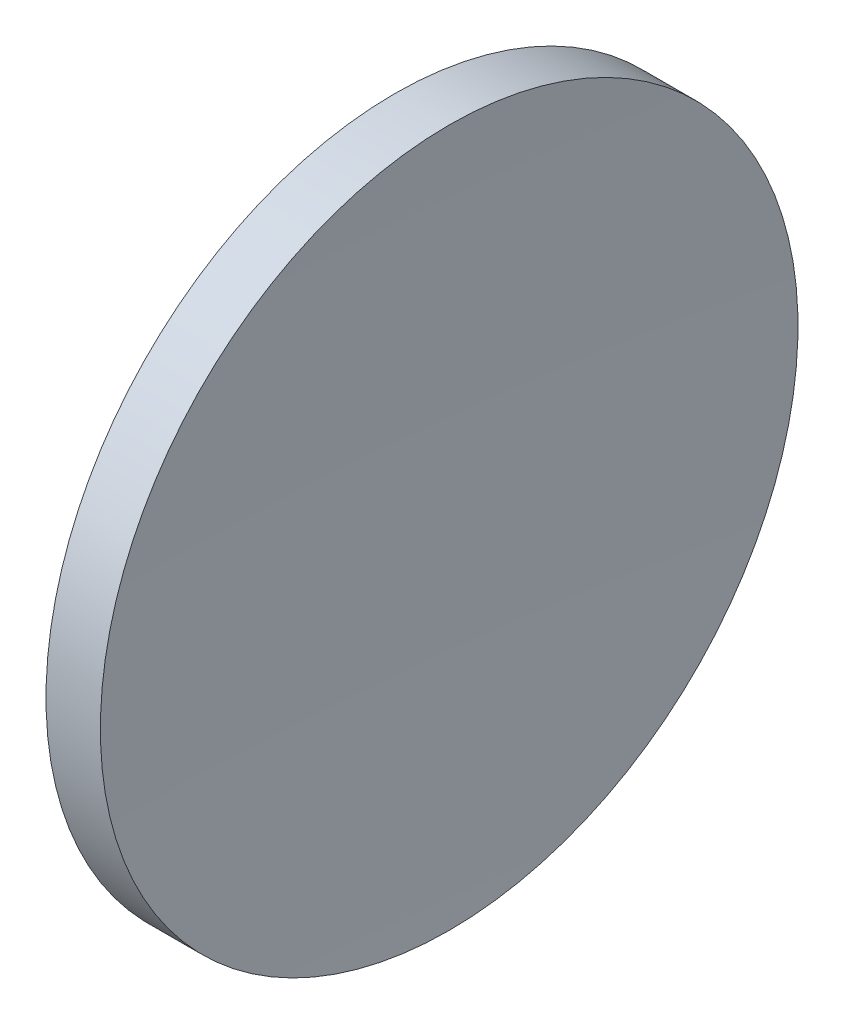
ISO-10303-21;
HEADER;
FILE_DESCRIPTION(('STEP AP214'),'2;1');
FILE_NAME('part.step','',(''),(''),'','','');
FILE_SCHEMA(('AUTOMOTIVE_DESIGN { 1 0 10303 214 1 1 1 1 }'));
ENDSEC;
DATA;
#1=APPLICATION_CONTEXT('core data for automotive mechanical design processes');
#2=APPLICATION_PROTOCOL_DEFINITION('international standard','automotive_design',2000,#1);
#3=PRODUCT_CONTEXT('',#1,'mechanical');
#4=PRODUCT('Part','Part','',(#3));
#5=PRODUCT_RELATED_PRODUCT_CATEGORY('part','',(#4));
#6=PRODUCT_DEFINITION_FORMATION('','',#4);
#7=PRODUCT_DEFINITION_CONTEXT('part definition',#1,'design');
#8=PRODUCT_DEFINITION('design','',#6,#7);
#9=PRODUCT_DEFINITION_SHAPE('','',#8);
#10=(LENGTH_UNIT() NAMED_UNIT(*) SI_UNIT(.MILLI.,.METRE.));
#11=(NAMED_UNIT(*) PLANE_ANGLE_UNIT() SI_UNIT($,.RADIAN.));
#12=(NAMED_UNIT(*) SI_UNIT($,.STERADIAN.) SOLID_ANGLE_UNIT());
#13=UNCERTAINTY_MEASURE_WITH_UNIT(LENGTH_MEASURE(1.E-05),#10,'distance_accuracy_value','');
#14=(GEOMETRIC_REPRESENTATION_CONTEXT(3) GLOBAL_UNCERTAINTY_ASSIGNED_CONTEXT((#13)) GLOBAL_UNIT_ASSIGNED_CONTEXT((#10,
#11,#12)) REPRESENTATION_CONTEXT('',''));
#15=CARTESIAN_POINT('',(0.,0.,0.));
#16=DIRECTION('',(0.,0.,1.));
#17=DIRECTION('',(1.,0.,0.));
#18=AXIS2_PLACEMENT_3D('',#15,#16,#17);
#19=CARTESIAN_POINT('',(277.255421315556,65.2168404709403,0.));
#20=DIRECTION('',(-1.,0.,0.));
#21=DIRECTION('',(0.,1.,0.));
#22=AXIS2_PLACEMENT_3D('',#19,#20,#21);
#23=SPHERICAL_SURFACE('',#22,154.4);
#24=CARTESIAN_POINT('',(124.032024358694,65.2168404709403,0.));
#25=DIRECTION('',(-1.,0.,0.));
#26=DIRECTION('',(0.,-1.,0.));
#27=AXIS2_PLACEMENT_3D('',#24,#25,#26);
#28=CIRCLE('',#27,19.025);
#29=CARTESIAN_POINT('',(124.032024358694,46.1918404709403,0.));
#30=VERTEX_POINT('',#29);
#31=EDGE_CURVE('E41',#30,#30,#28,.T.);
#32=ORIENTED_EDGE('',*,*,#31,.T.);
#33=EDGE_LOOP('',(#32));
#34=FACE_BOUND('',#33,.T.);
#35=ADVANCED_FACE('F35',(#34),#23,.T.);
#36=CARTESIAN_POINT('',(536.555421315556,65.2168404709403,0.));
#37=DIRECTION('',(-1.,0.,0.));
#38=DIRECTION('',(0.,1.,0.));
#39=AXIS2_PLACEMENT_3D('',#36,#37,#38);
#40=SPHERICAL_SURFACE('',#39,410.);
#41=CARTESIAN_POINT('',(126.997062378762,65.2168404709403,0.));
#42=DIRECTION('',(-1.,0.,0.));
#43=DIRECTION('',(0.,-1.,0.));
#44=AXIS2_PLACEMENT_3D('',#41,#42,#43);
#45=CIRCLE('',#44,19.025);
#46=CARTESIAN_POINT('',(126.997062378762,46.1918404709404,0.));
#47=VERTEX_POINT('',#46);
#48=EDGE_CURVE('E10',#47,#47,#45,.T.);
#49=ORIENTED_EDGE('',*,*,#48,.F.);
#50=EDGE_LOOP('',(#49));
#51=FACE_BOUND('',#50,.T.);
#52=ADVANCED_FACE('F50',(#51),#40,.F.);
#53=CARTESIAN_POINT('',(115.944491297963,65.2168404709403,0.));
#54=DIRECTION('',(-1.,0.,0.));
#55=DIRECTION('',(0.,-1.,0.));
#56=AXIS2_PLACEMENT_3D('',#53,#54,#55);
#57=CYLINDRICAL_SURFACE('',#56,19.025);
#58=ORIENTED_EDGE('',*,*,#31,.F.);
#59=EDGE_LOOP('',(#58));
#60=FACE_BOUND('',#59,.T.);
#61=ORIENTED_EDGE('',*,*,#48,.T.);
#62=EDGE_LOOP('',(#61));
#63=FACE_BOUND('',#62,.T.);
#64=ADVANCED_FACE('F48',(#60,#63),#57,.T.);
#65=CLOSED_SHELL('',(#35,#52,#64));
#66=MANIFOLD_SOLID_BREP('B2',#65);
#67=ADVANCED_BREP_SHAPE_REPRESENTATION('',(#18,#66),#14);
#68=SHAPE_DEFINITION_REPRESENTATION(#9,#67);
ENDSEC;
END-ISO-10303-21;
